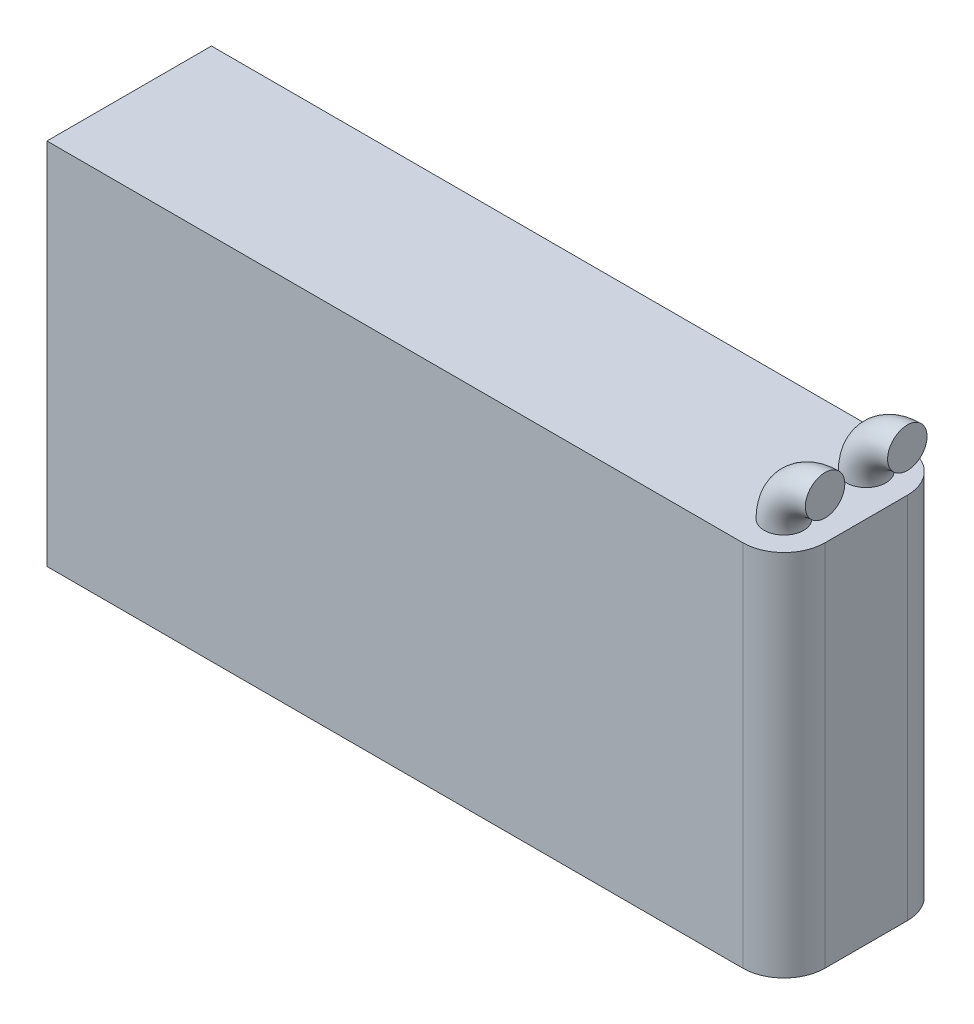
ISO-10303-21;
HEADER;
FILE_DESCRIPTION(('STEP AP214'),'2;1');
FILE_NAME('part.step','',(''),(''),'','','');
FILE_SCHEMA(('AUTOMOTIVE_DESIGN { 1 0 10303 214 1 1 1 1 }'));
ENDSEC;
DATA;
#1=APPLICATION_CONTEXT('core data for automotive mechanical design processes');
#2=APPLICATION_PROTOCOL_DEFINITION('international standard','automotive_design',2000,#1);
#3=PRODUCT_CONTEXT('',#1,'mechanical');
#4=PRODUCT('Part','Part','',(#3));
#5=PRODUCT_RELATED_PRODUCT_CATEGORY('part','',(#4));
#6=PRODUCT_DEFINITION_FORMATION('','',#4);
#7=PRODUCT_DEFINITION_CONTEXT('part definition',#1,'design');
#8=PRODUCT_DEFINITION('design','',#6,#7);
#9=PRODUCT_DEFINITION_SHAPE('','',#8);
#10=(LENGTH_UNIT() NAMED_UNIT(*) SI_UNIT(.MILLI.,.METRE.));
#11=(NAMED_UNIT(*) PLANE_ANGLE_UNIT() SI_UNIT($,.RADIAN.));
#12=(NAMED_UNIT(*) SI_UNIT($,.STERADIAN.) SOLID_ANGLE_UNIT());
#13=UNCERTAINTY_MEASURE_WITH_UNIT(LENGTH_MEASURE(1.E-05),#10,'distance_accuracy_value','');
#14=(GEOMETRIC_REPRESENTATION_CONTEXT(3) GLOBAL_UNCERTAINTY_ASSIGNED_CONTEXT((#13)) GLOBAL_UNIT_ASSIGNED_CONTEXT((#10,
#11,#12)) REPRESENTATION_CONTEXT('',''));
#15=CARTESIAN_POINT('',(0.,0.,0.));
#16=DIRECTION('',(0.,0.,1.));
#17=DIRECTION('',(1.,0.,0.));
#18=AXIS2_PLACEMENT_3D('',#15,#16,#17);
#19=CARTESIAN_POINT('',(35.56,35.56,-7.9375));
#20=DIRECTION('',(-1.,0.,0.));
#21=DIRECTION('',(0.,0.,1.));
#22=AXIS2_PLACEMENT_3D('',#19,#20,#21);
#23=PLANE('',#22);
#24=DIRECTION('',(0.,0.,-1.));
#25=VECTOR('',#24,1.);
#26=CARTESIAN_POINT('',(35.56,0.,-7.9375));
#27=LINE('',#26,#25);
#28=CARTESIAN_POINT('',(35.56,0.,3.96875));
#29=VERTEX_POINT('',#28);
#30=CARTESIAN_POINT('',(35.56,0.,-3.96875));
#31=VERTEX_POINT('',#30);
#32=EDGE_CURVE('E122',#29,#31,#27,.T.);
#33=ORIENTED_EDGE('',*,*,#32,.T.);
#34=DIRECTION('',(0.,-1.,0.));
#35=VECTOR('',#34,1.);
#36=CARTESIAN_POINT('',(35.56,35.56,-3.96875));
#37=LINE('',#36,#35);
#38=CARTESIAN_POINT('',(35.56,35.56,-3.96875));
#39=VERTEX_POINT('',#38);
#40=EDGE_CURVE('E60',#31,#39,#37,.F.);
#41=ORIENTED_EDGE('',*,*,#40,.T.);
#42=DIRECTION('',(0.,0.,-1.));
#43=VECTOR('',#42,1.);
#44=CARTESIAN_POINT('',(35.56,35.56,-7.9375));
#45=LINE('',#44,#43);
#46=CARTESIAN_POINT('',(35.56,35.56,3.96875));
#47=VERTEX_POINT('',#46);
#48=EDGE_CURVE('E103',#47,#39,#45,.T.);
#49=ORIENTED_EDGE('',*,*,#48,.F.);
#50=DIRECTION('',(0.,-1.,0.));
#51=VECTOR('',#50,1.);
#52=CARTESIAN_POINT('',(35.56,35.56,3.96875));
#53=LINE('',#52,#51);
#54=EDGE_CURVE('E136',#47,#29,#53,.T.);
#55=ORIENTED_EDGE('',*,*,#54,.T.);
#56=EDGE_LOOP('',(#33,#41,#49,#55));
#57=FACE_BOUND('',#56,.T.);
#58=ADVANCED_FACE('F39',(#57),#23,.F.);
#59=CARTESIAN_POINT('',(-35.56,35.56,-7.9375));
#60=DIRECTION('',(0.,0.,1.));
#61=DIRECTION('',(1.,0.,0.));
#62=AXIS2_PLACEMENT_3D('',#59,#60,#61);
#63=PLANE('',#62);
#64=DIRECTION('',(-1.,0.,0.));
#65=VECTOR('',#64,1.);
#66=CARTESIAN_POINT('',(-35.56,35.56,-7.9375));
#67=LINE('',#66,#65);
#68=CARTESIAN_POINT('',(31.59125,35.56,-7.9375));
#69=VERTEX_POINT('',#68);
#70=CARTESIAN_POINT('',(-35.56,35.56,-7.9375));
#71=VERTEX_POINT('',#70);
#72=EDGE_CURVE('E93',#69,#71,#67,.T.);
#73=ORIENTED_EDGE('',*,*,#72,.F.);
#74=DIRECTION('',(0.,-1.,0.));
#75=VECTOR('',#74,1.);
#76=CARTESIAN_POINT('',(31.59125,35.56,-7.9375));
#77=LINE('',#76,#75);
#78=CARTESIAN_POINT('',(31.59125,0.,-7.9375));
#79=VERTEX_POINT('',#78);
#80=EDGE_CURVE('E112',#69,#79,#77,.T.);
#81=ORIENTED_EDGE('',*,*,#80,.T.);
#82=DIRECTION('',(-1.,0.,0.));
#83=VECTOR('',#82,1.);
#84=CARTESIAN_POINT('',(-35.56,0.,-7.9375));
#85=LINE('',#84,#83);
#86=CARTESIAN_POINT('',(-35.56,0.,-7.9375));
#87=VERTEX_POINT('',#86);
#88=EDGE_CURVE('E109',#79,#87,#85,.T.);
#89=ORIENTED_EDGE('',*,*,#88,.T.);
#90=DIRECTION('',(0.,-1.,0.));
#91=VECTOR('',#90,1.);
#92=CARTESIAN_POINT('',(-35.56,35.56,-7.9375));
#93=LINE('',#92,#91);
#94=EDGE_CURVE('E106',#71,#87,#93,.T.);
#95=ORIENTED_EDGE('',*,*,#94,.F.);
#96=EDGE_LOOP('',(#73,#81,#89,#95));
#97=FACE_BOUND('',#96,.T.);
#98=ADVANCED_FACE('F107',(#97),#63,.F.);
#99=CARTESIAN_POINT('',(-35.56,35.56,-7.9375));
#100=DIRECTION('',(1.,0.,0.));
#101=DIRECTION('',(0.,0.,-1.));
#102=AXIS2_PLACEMENT_3D('',#99,#100,#101);
#103=PLANE('',#102);
#104=DIRECTION('',(0.,0.,1.));
#105=VECTOR('',#104,1.);
#106=CARTESIAN_POINT('',(-35.56,0.,-7.9375));
#107=LINE('',#106,#105);
#108=CARTESIAN_POINT('',(-35.56,0.,7.9375));
#109=VERTEX_POINT('',#108);
#110=EDGE_CURVE('E126',#87,#109,#107,.T.);
#111=ORIENTED_EDGE('',*,*,#110,.T.);
#112=DIRECTION('',(0.,-1.,0.));
#113=VECTOR('',#112,1.);
#114=CARTESIAN_POINT('',(-35.56,35.56,7.9375));
#115=LINE('',#114,#113);
#116=CARTESIAN_POINT('',(-35.56,35.56,7.9375));
#117=VERTEX_POINT('',#116);
#118=EDGE_CURVE('E113',#117,#109,#115,.T.);
#119=ORIENTED_EDGE('',*,*,#118,.F.);
#120=DIRECTION('',(0.,0.,1.));
#121=VECTOR('',#120,1.);
#122=CARTESIAN_POINT('',(-35.56,35.56,-7.9375));
#123=LINE('',#122,#121);
#124=EDGE_CURVE('E97',#71,#117,#123,.T.);
#125=ORIENTED_EDGE('',*,*,#124,.F.);
#126=ORIENTED_EDGE('',*,*,#94,.T.);
#127=EDGE_LOOP('',(#111,#119,#125,#126));
#128=FACE_BOUND('',#127,.T.);
#129=ADVANCED_FACE('F115',(#128),#103,.F.);
#130=CARTESIAN_POINT('',(-35.56,35.56,7.9375));
#131=DIRECTION('',(0.,0.,-1.));
#132=DIRECTION('',(-1.,0.,0.));
#133=AXIS2_PLACEMENT_3D('',#130,#131,#132);
#134=PLANE('',#133);
#135=DIRECTION('',(1.,0.,0.));
#136=VECTOR('',#135,1.);
#137=CARTESIAN_POINT('',(-35.56,0.,7.9375));
#138=LINE('',#137,#136);
#139=CARTESIAN_POINT('',(31.59125,0.,7.9375));
#140=VERTEX_POINT('',#139);
#141=EDGE_CURVE('E128',#109,#140,#138,.T.);
#142=ORIENTED_EDGE('',*,*,#141,.T.);
#143=DIRECTION('',(0.,-1.,0.));
#144=VECTOR('',#143,1.);
#145=CARTESIAN_POINT('',(31.59125,35.56,7.9375));
#146=LINE('',#145,#144);
#147=CARTESIAN_POINT('',(31.59125,35.56,7.9375));
#148=VERTEX_POINT('',#147);
#149=EDGE_CURVE('E11',#140,#148,#146,.F.);
#150=ORIENTED_EDGE('',*,*,#149,.T.);
#151=DIRECTION('',(1.,0.,0.));
#152=VECTOR('',#151,1.);
#153=CARTESIAN_POINT('',(-35.56,35.56,7.9375));
#154=LINE('',#153,#152);
#155=EDGE_CURVE('E117',#117,#148,#154,.T.);
#156=ORIENTED_EDGE('',*,*,#155,.F.);
#157=ORIENTED_EDGE('',*,*,#118,.T.);
#158=EDGE_LOOP('',(#142,#150,#156,#157));
#159=FACE_BOUND('',#158,.T.);
#160=ADVANCED_FACE('F148',(#159),#134,.F.);
#161=CARTESIAN_POINT('',(0.,35.56,0.));
#162=DIRECTION('',(0.,1.,0.));
#163=DIRECTION('',(0.,0.,1.));
#164=AXIS2_PLACEMENT_3D('',#161,#162,#163);
#165=PLANE('',#164);
#166=CARTESIAN_POINT('',(31.59125,35.56,3.96875));
#167=DIRECTION('',(0.,1.,0.));
#168=DIRECTION('',(0.,0.,1.));
#169=AXIS2_PLACEMENT_3D('',#166,#167,#168);
#170=CIRCLE('',#169,1.905);
#171=CARTESIAN_POINT('',(29.68625,35.56,3.96875));
#172=VERTEX_POINT('',#171);
#173=EDGE_CURVE('E194',#172,#172,#170,.T.);
#174=ORIENTED_EDGE('',*,*,#173,.F.);
#175=EDGE_LOOP('',(#174));
#176=FACE_BOUND('',#175,.T.);
#177=CARTESIAN_POINT('',(31.59125,35.56,-3.96875));
#178=DIRECTION('',(0.,1.,0.));
#179=DIRECTION('',(0.,0.,1.));
#180=AXIS2_PLACEMENT_3D('',#177,#178,#179);
#181=CIRCLE('',#180,1.905);
#182=CARTESIAN_POINT('',(29.68625,35.56,-3.96875));
#183=VERTEX_POINT('',#182);
#184=EDGE_CURVE('E200',#183,#183,#181,.T.);
#185=ORIENTED_EDGE('',*,*,#184,.F.);
#186=EDGE_LOOP('',(#185));
#187=FACE_BOUND('',#186,.T.);
#188=ORIENTED_EDGE('',*,*,#48,.T.);
#189=CARTESIAN_POINT('',(31.59125,35.56,-3.96875));
#190=DIRECTION('',(0.,1.,0.));
#191=DIRECTION('',(0.,0.,1.));
#192=AXIS2_PLACEMENT_3D('',#189,#190,#191);
#193=CIRCLE('',#192,3.96875);
#194=EDGE_CURVE('E47',#39,#69,#193,.T.);
#195=ORIENTED_EDGE('',*,*,#194,.T.);
#196=ORIENTED_EDGE('',*,*,#72,.T.);
#197=ORIENTED_EDGE('',*,*,#124,.T.);
#198=ORIENTED_EDGE('',*,*,#155,.T.);
#199=CARTESIAN_POINT('',(31.59125,35.56,3.96875));
#200=DIRECTION('',(0.,1.,0.));
#201=DIRECTION('',(0.,0.,1.));
#202=AXIS2_PLACEMENT_3D('',#199,#200,#201);
#203=CIRCLE('',#202,3.96875);
#204=EDGE_CURVE('E140',#148,#47,#203,.T.);
#205=ORIENTED_EDGE('',*,*,#204,.T.);
#206=EDGE_LOOP('',(#188,#195,#196,#197,#198,#205));
#207=FACE_BOUND('',#206,.T.);
#208=ADVANCED_FACE('F95',(#176,#187,#207),#165,.T.);
#209=CARTESIAN_POINT('',(0.,0.,0.));
#210=DIRECTION('',(0.,1.,0.));
#211=DIRECTION('',(0.,0.,1.));
#212=AXIS2_PLACEMENT_3D('',#209,#210,#211);
#213=PLANE('',#212);
#214=ORIENTED_EDGE('',*,*,#88,.F.);
#215=CARTESIAN_POINT('',(31.59125,0.,-3.96875));
#216=DIRECTION('',(0.,1.,0.));
#217=DIRECTION('',(0.,0.,1.));
#218=AXIS2_PLACEMENT_3D('',#215,#216,#217);
#219=CIRCLE('',#218,3.96875);
#220=EDGE_CURVE('E134',#79,#31,#219,.F.);
#221=ORIENTED_EDGE('',*,*,#220,.T.);
#222=ORIENTED_EDGE('',*,*,#32,.F.);
#223=CARTESIAN_POINT('',(31.59125,0.,3.96875));
#224=DIRECTION('',(0.,1.,0.));
#225=DIRECTION('',(0.,0.,1.));
#226=AXIS2_PLACEMENT_3D('',#223,#224,#225);
#227=CIRCLE('',#226,3.96875);
#228=EDGE_CURVE('E132',#29,#140,#227,.F.);
#229=ORIENTED_EDGE('',*,*,#228,.T.);
#230=ORIENTED_EDGE('',*,*,#141,.F.);
#231=ORIENTED_EDGE('',*,*,#110,.F.);
#232=EDGE_LOOP('',(#214,#221,#222,#229,#230,#231));
#233=FACE_BOUND('',#232,.T.);
#234=ADVANCED_FACE('F147',(#233),#213,.F.);
#235=CARTESIAN_POINT('',(31.59125,35.56,-3.96875));
#236=DIRECTION('',(0.,-1.,0.));
#237=DIRECTION('',(0.,0.,-1.));
#238=AXIS2_PLACEMENT_3D('',#235,#236,#237);
#239=CYLINDRICAL_SURFACE('',#238,3.96875);
#240=ORIENTED_EDGE('',*,*,#194,.F.);
#241=ORIENTED_EDGE('',*,*,#40,.F.);
#242=ORIENTED_EDGE('',*,*,#220,.F.);
#243=ORIENTED_EDGE('',*,*,#80,.F.);
#244=EDGE_LOOP('',(#240,#241,#242,#243));
#245=FACE_BOUND('',#244,.T.);
#246=ADVANCED_FACE('F166',(#245),#239,.T.);
#247=CARTESIAN_POINT('',(31.59125,35.56,3.96875));
#248=DIRECTION('',(0.,-1.,0.));
#249=DIRECTION('',(0.,0.,-1.));
#250=AXIS2_PLACEMENT_3D('',#247,#248,#249);
#251=CYLINDRICAL_SURFACE('',#250,3.96875);
#252=ORIENTED_EDGE('',*,*,#204,.F.);
#253=ORIENTED_EDGE('',*,*,#149,.F.);
#254=ORIENTED_EDGE('',*,*,#228,.F.);
#255=ORIENTED_EDGE('',*,*,#54,.F.);
#256=EDGE_LOOP('',(#252,#253,#254,#255));
#257=FACE_BOUND('',#256,.T.);
#258=ADVANCED_FACE('F41',(#257),#251,.T.);
#259=CARTESIAN_POINT('',(35.56,35.56,-3.96875));
#260=DIRECTION('',(0.,0.,1.));
#261=DIRECTION('',(1.,0.,0.));
#262=AXIS2_PLACEMENT_3D('',#259,#260,#261);
#263=TOROIDAL_SURFACE('',#262,3.96875,1.905);
#264=CARTESIAN_POINT('',(35.56,39.52875,-3.96875));
#265=DIRECTION('',(1.,0.,0.));
#266=DIRECTION('',(0.,0.,1.));
#267=AXIS2_PLACEMENT_3D('',#264,#265,#266);
#268=CIRCLE('',#267,1.905);
#269=CARTESIAN_POINT('',(35.56,41.43375,-3.96875));
#270=VERTEX_POINT('',#269);
#271=EDGE_CURVE('E197',#270,#270,#268,.T.);
#272=CARTESIAN_POINT('',(35.56,35.56,-3.96875));
#273=DIRECTION('',(0.,0.,1.));
#274=DIRECTION('',(1.,0.,0.));
#275=AXIS2_PLACEMENT_3D('',#272,#273,#274);
#276=CIRCLE('',#275,5.87375);
#277=EDGE_CURVE('',#270,#183,#276,.T.);
#278=ORIENTED_EDGE('',*,*,#271,.F.);
#279=ORIENTED_EDGE('',*,*,#184,.T.);
#280=ORIENTED_EDGE('',*,*,#277,.T.);
#281=ORIENTED_EDGE('',*,*,#277,.F.);
#282=EDGE_LOOP('',(#278,#280,#279,#281));
#283=FACE_BOUND('',#282,.T.);
#284=ADVANCED_FACE('F172',(#283),#263,.T.);
#285=CARTESIAN_POINT('',(35.56,39.52875,-3.96875));
#286=DIRECTION('',(1.,0.,0.));
#287=DIRECTION('',(0.,0.,1.));
#288=AXIS2_PLACEMENT_3D('',#285,#286,#287);
#289=PLANE('',#288);
#290=ORIENTED_EDGE('',*,*,#271,.T.);
#291=EDGE_LOOP('',(#290));
#292=FACE_BOUND('',#291,.T.);
#293=ADVANCED_FACE('F178',(#292),#289,.T.);
#294=CARTESIAN_POINT('',(35.56,35.56,3.96875));
#295=DIRECTION('',(0.,0.,1.));
#296=DIRECTION('',(1.,0.,0.));
#297=AXIS2_PLACEMENT_3D('',#294,#295,#296);
#298=TOROIDAL_SURFACE('',#297,3.96875,1.905);
#299=CARTESIAN_POINT('',(35.56,39.52875,3.96875));
#300=DIRECTION('',(1.,0.,0.));
#301=DIRECTION('',(0.,0.,1.));
#302=AXIS2_PLACEMENT_3D('',#299,#300,#301);
#303=CIRCLE('',#302,1.905);
#304=CARTESIAN_POINT('',(35.56,41.43375,3.96875));
#305=VERTEX_POINT('',#304);
#306=EDGE_CURVE('E124',#305,#305,#303,.T.);
#307=CARTESIAN_POINT('',(35.56,35.56,3.96875));
#308=DIRECTION('',(0.,0.,1.));
#309=DIRECTION('',(1.,0.,0.));
#310=AXIS2_PLACEMENT_3D('',#307,#308,#309);
#311=CIRCLE('',#310,5.87375);
#312=EDGE_CURVE('',#305,#172,#311,.T.);
#313=ORIENTED_EDGE('',*,*,#306,.F.);
#314=ORIENTED_EDGE('',*,*,#173,.T.);
#315=ORIENTED_EDGE('',*,*,#312,.T.);
#316=ORIENTED_EDGE('',*,*,#312,.F.);
#317=EDGE_LOOP('',(#313,#315,#314,#316));
#318=FACE_BOUND('',#317,.T.);
#319=ADVANCED_FACE('F182',(#318),#298,.T.);
#320=CARTESIAN_POINT('',(35.56,39.52875,3.96875));
#321=DIRECTION('',(1.,0.,0.));
#322=DIRECTION('',(0.,0.,1.));
#323=AXIS2_PLACEMENT_3D('',#320,#321,#322);
#324=PLANE('',#323);
#325=ORIENTED_EDGE('',*,*,#306,.T.);
#326=EDGE_LOOP('',(#325));
#327=FACE_BOUND('',#326,.T.);
#328=ADVANCED_FACE('F186',(#327),#324,.T.);
#329=CLOSED_SHELL('',(#58,#98,#129,#160,#208,#234,#246,#258,#284,#293,#319,#328));
#330=MANIFOLD_SOLID_BREP('B2',#329);
#331=ADVANCED_BREP_SHAPE_REPRESENTATION('',(#18,#330),#14);
#332=SHAPE_DEFINITION_REPRESENTATION(#9,#331);
ENDSEC;
END-ISO-10303-21;
